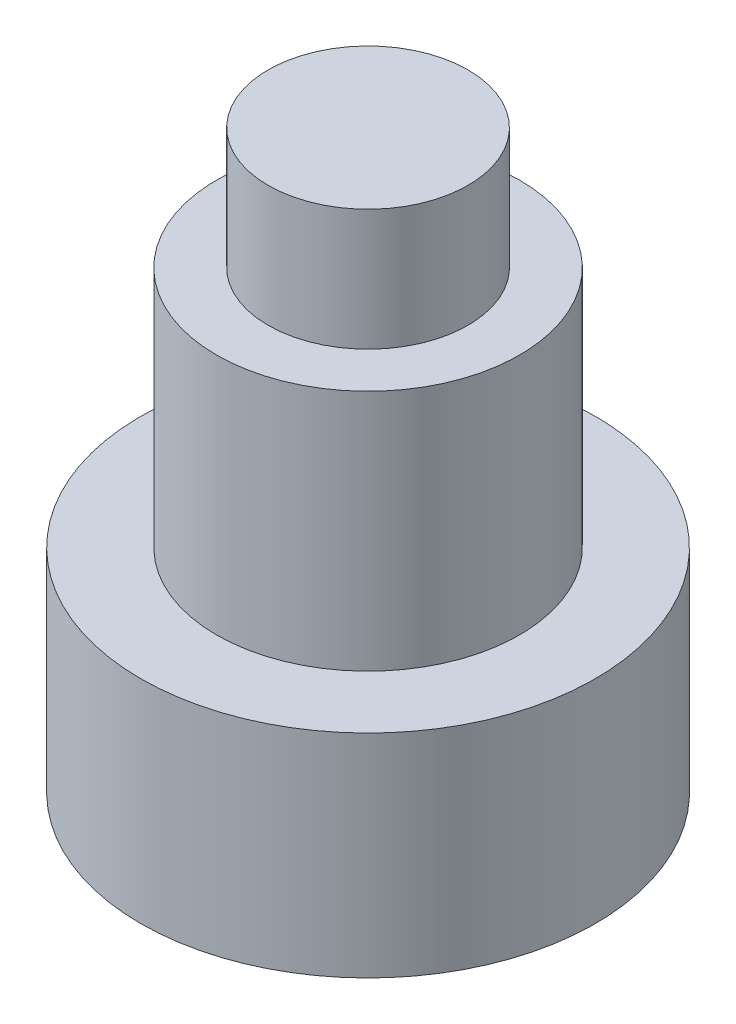
ISO-10303-21;
HEADER;
FILE_DESCRIPTION(('STEP AP214'),'2;1');
FILE_NAME('part.step','',(''),(''),'','','');
FILE_SCHEMA(('AUTOMOTIVE_DESIGN { 1 0 10303 214 1 1 1 1 }'));
ENDSEC;
DATA;
#1=APPLICATION_CONTEXT('core data for automotive mechanical design processes');
#2=APPLICATION_PROTOCOL_DEFINITION('international standard','automotive_design',2000,#1);
#3=PRODUCT_CONTEXT('',#1,'mechanical');
#4=PRODUCT('Part','Part','',(#3));
#5=PRODUCT_RELATED_PRODUCT_CATEGORY('part','',(#4));
#6=PRODUCT_DEFINITION_FORMATION('','',#4);
#7=PRODUCT_DEFINITION_CONTEXT('part definition',#1,'design');
#8=PRODUCT_DEFINITION('design','',#6,#7);
#9=PRODUCT_DEFINITION_SHAPE('','',#8);
#10=(LENGTH_UNIT() NAMED_UNIT(*) SI_UNIT(.MILLI.,.METRE.));
#11=(NAMED_UNIT(*) PLANE_ANGLE_UNIT() SI_UNIT($,.RADIAN.));
#12=(NAMED_UNIT(*) SI_UNIT($,.STERADIAN.) SOLID_ANGLE_UNIT());
#13=UNCERTAINTY_MEASURE_WITH_UNIT(LENGTH_MEASURE(1.E-05),#10,'distance_accuracy_value','');
#14=(GEOMETRIC_REPRESENTATION_CONTEXT(3) GLOBAL_UNCERTAINTY_ASSIGNED_CONTEXT((#13)) GLOBAL_UNIT_ASSIGNED_CONTEXT((#10,
#11,#12)) REPRESENTATION_CONTEXT('',''));
#15=CARTESIAN_POINT('',(0.,0.,0.));
#16=DIRECTION('',(0.,0.,1.));
#17=DIRECTION('',(1.,0.,0.));
#18=AXIS2_PLACEMENT_3D('',#15,#16,#17);
#19=CARTESIAN_POINT('',(0.,7.5,0.));
#20=DIRECTION('',(0.,-1.,0.));
#21=DIRECTION('',(0.,0.,-1.));
#22=AXIS2_PLACEMENT_3D('',#19,#20,#21);
#23=CYLINDRICAL_SURFACE('',#22,3.75);
#24=CARTESIAN_POINT('',(0.,0.,0.));
#25=DIRECTION('',(0.,1.,0.));
#26=DIRECTION('',(0.,0.,1.));
#27=AXIS2_PLACEMENT_3D('',#24,#25,#26);
#28=CIRCLE('',#27,3.75);
#29=CARTESIAN_POINT('',(0.,0.,3.75));
#30=VERTEX_POINT('',#29);
#31=EDGE_CURVE('E40',#30,#30,#28,.T.);
#32=ORIENTED_EDGE('',*,*,#31,.T.);
#33=EDGE_LOOP('',(#32));
#34=FACE_BOUND('',#33,.T.);
#35=CARTESIAN_POINT('',(0.,3.5,0.));
#36=DIRECTION('',(0.,1.,0.));
#37=DIRECTION('',(0.,0.,1.));
#38=AXIS2_PLACEMENT_3D('',#35,#36,#37);
#39=CIRCLE('',#38,3.75);
#40=CARTESIAN_POINT('',(0.,3.5,3.75));
#41=VERTEX_POINT('',#40);
#42=EDGE_CURVE('E50',#41,#41,#39,.T.);
#43=ORIENTED_EDGE('',*,*,#42,.F.);
#44=EDGE_LOOP('',(#43));
#45=FACE_BOUND('',#44,.T.);
#46=ADVANCED_FACE('F37',(#34,#45),#23,.T.);
#47=CARTESIAN_POINT('',(0.,0.,0.));
#48=DIRECTION('',(0.,1.,0.));
#49=DIRECTION('',(0.,0.,1.));
#50=AXIS2_PLACEMENT_3D('',#47,#48,#49);
#51=PLANE('',#50);
#52=ORIENTED_EDGE('',*,*,#31,.F.);
#53=EDGE_LOOP('',(#52));
#54=FACE_BOUND('',#53,.T.);
#55=ADVANCED_FACE('F68',(#54),#51,.F.);
#56=CARTESIAN_POINT('',(0.,3.5,0.));
#57=DIRECTION('',(0.,1.,0.));
#58=DIRECTION('',(0.,0.,1.));
#59=AXIS2_PLACEMENT_3D('',#56,#57,#58);
#60=PLANE('',#59);
#61=CARTESIAN_POINT('',(0.,3.5,0.));
#62=DIRECTION('',(0.,1.,0.));
#63=DIRECTION('',(0.,0.,1.));
#64=AXIS2_PLACEMENT_3D('',#61,#62,#63);
#65=CIRCLE('',#64,2.5);
#66=CARTESIAN_POINT('',(0.,3.5,2.5));
#67=VERTEX_POINT('',#66);
#68=EDGE_CURVE('E54',#67,#67,#65,.T.);
#69=ORIENTED_EDGE('',*,*,#68,.F.);
#70=EDGE_LOOP('',(#69));
#71=FACE_BOUND('',#70,.T.);
#72=ORIENTED_EDGE('',*,*,#42,.T.);
#73=EDGE_LOOP('',(#72));
#74=FACE_BOUND('',#73,.T.);
#75=ADVANCED_FACE('F65',(#71,#74),#60,.T.);
#76=CARTESIAN_POINT('',(0.,3.5,0.));
#77=DIRECTION('',(0.,1.,0.));
#78=DIRECTION('',(0.,0.,1.));
#79=AXIS2_PLACEMENT_3D('',#76,#77,#78);
#80=CYLINDRICAL_SURFACE('',#79,2.5);
#81=ORIENTED_EDGE('',*,*,#68,.T.);
#82=EDGE_LOOP('',(#81));
#83=FACE_BOUND('',#82,.T.);
#84=CARTESIAN_POINT('',(0.,7.5,0.));
#85=DIRECTION('',(0.,1.,0.));
#86=DIRECTION('',(0.,0.,1.));
#87=AXIS2_PLACEMENT_3D('',#84,#85,#86);
#88=CIRCLE('',#87,2.5);
#89=CARTESIAN_POINT('',(0.,7.5,2.5));
#90=VERTEX_POINT('',#89);
#91=EDGE_CURVE('E58',#90,#90,#88,.T.);
#92=ORIENTED_EDGE('',*,*,#91,.F.);
#93=EDGE_LOOP('',(#92));
#94=FACE_BOUND('',#93,.T.);
#95=ADVANCED_FACE('F80',(#83,#94),#80,.T.);
#96=CARTESIAN_POINT('',(0.,7.5,0.));
#97=DIRECTION('',(0.,1.,0.));
#98=DIRECTION('',(0.,0.,1.));
#99=AXIS2_PLACEMENT_3D('',#96,#97,#98);
#100=PLANE('',#99);
#101=CARTESIAN_POINT('',(0.,7.5,0.));
#102=DIRECTION('',(0.,1.,0.));
#103=DIRECTION('',(0.,0.,1.));
#104=AXIS2_PLACEMENT_3D('',#101,#102,#103);
#105=CIRCLE('',#104,1.65);
#106=CARTESIAN_POINT('',(0.,7.5,1.65));
#107=VERTEX_POINT('',#106);
#108=EDGE_CURVE('E10',#107,#107,#105,.T.);
#109=ORIENTED_EDGE('',*,*,#108,.F.);
#110=EDGE_LOOP('',(#109));
#111=FACE_BOUND('',#110,.T.);
#112=ORIENTED_EDGE('',*,*,#91,.T.);
#113=EDGE_LOOP('',(#112));
#114=FACE_BOUND('',#113,.T.);
#115=ADVANCED_FACE('F84',(#111,#114),#100,.T.);
#116=CARTESIAN_POINT('',(0.,9.5,0.));
#117=DIRECTION('',(0.,-1.,0.));
#118=DIRECTION('',(0.,0.,-1.));
#119=AXIS2_PLACEMENT_3D('',#116,#117,#118);
#120=CYLINDRICAL_SURFACE('',#119,1.65);
#121=CARTESIAN_POINT('',(0.,9.5,0.));
#122=DIRECTION('',(0.,1.,0.));
#123=DIRECTION('',(0.,0.,1.));
#124=AXIS2_PLACEMENT_3D('',#121,#122,#123);
#125=CIRCLE('',#124,1.65);
#126=CARTESIAN_POINT('',(0.,9.5,1.65));
#127=VERTEX_POINT('',#126);
#128=EDGE_CURVE('E53',#127,#127,#125,.T.);
#129=ORIENTED_EDGE('',*,*,#128,.F.);
#130=EDGE_LOOP('',(#129));
#131=FACE_BOUND('',#130,.T.);
#132=ORIENTED_EDGE('',*,*,#108,.T.);
#133=EDGE_LOOP('',(#132));
#134=FACE_BOUND('',#133,.T.);
#135=ADVANCED_FACE('F86',(#131,#134),#120,.T.);
#136=CARTESIAN_POINT('',(0.,9.5,0.));
#137=DIRECTION('',(0.,1.,0.));
#138=DIRECTION('',(0.,0.,1.));
#139=AXIS2_PLACEMENT_3D('',#136,#137,#138);
#140=PLANE('',#139);
#141=ORIENTED_EDGE('',*,*,#128,.T.);
#142=EDGE_LOOP('',(#141));
#143=FACE_BOUND('',#142,.T.);
#144=ADVANCED_FACE('F94',(#143),#140,.T.);
#145=CLOSED_SHELL('',(#46,#55,#75,#95,#115,#135,#144));
#146=MANIFOLD_SOLID_BREP('B2',#145);
#147=ADVANCED_BREP_SHAPE_REPRESENTATION('',(#18,#146),#14);
#148=SHAPE_DEFINITION_REPRESENTATION(#9,#147);
ENDSEC;
END-ISO-10303-21;
